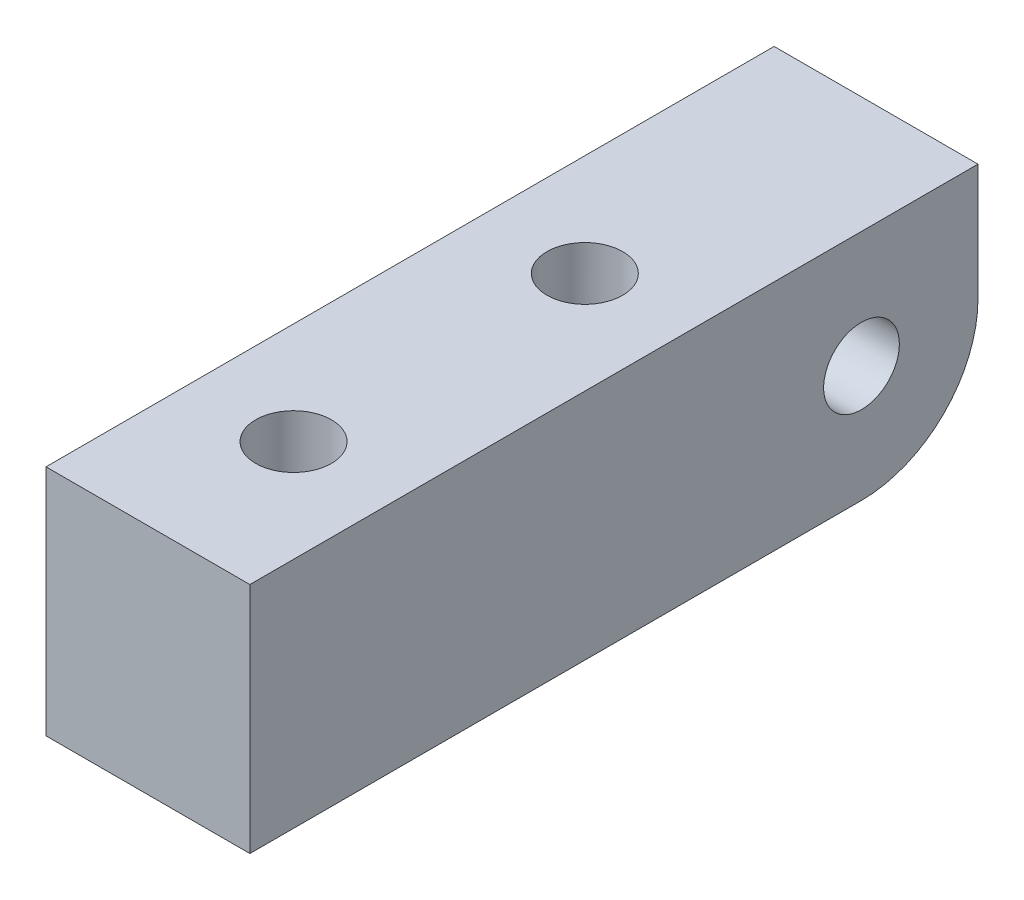
ISO-10303-21;
HEADER;
FILE_DESCRIPTION(('STEP AP214'),'2;1');
FILE_NAME('part.step','',(''),(''),'','','');
FILE_SCHEMA(('AUTOMOTIVE_DESIGN { 1 0 10303 214 1 1 1 1 }'));
ENDSEC;
DATA;
#1=APPLICATION_CONTEXT('core data for automotive mechanical design processes');
#2=APPLICATION_PROTOCOL_DEFINITION('international standard','automotive_design',2000,#1);
#3=PRODUCT_CONTEXT('',#1,'mechanical');
#4=PRODUCT('Part','Part','',(#3));
#5=PRODUCT_RELATED_PRODUCT_CATEGORY('part','',(#4));
#6=PRODUCT_DEFINITION_FORMATION('','',#4);
#7=PRODUCT_DEFINITION_CONTEXT('part definition',#1,'design');
#8=PRODUCT_DEFINITION('design','',#6,#7);
#9=PRODUCT_DEFINITION_SHAPE('','',#8);
#10=(LENGTH_UNIT() NAMED_UNIT(*) SI_UNIT(.MILLI.,.METRE.));
#11=(NAMED_UNIT(*) PLANE_ANGLE_UNIT() SI_UNIT($,.RADIAN.));
#12=(NAMED_UNIT(*) SI_UNIT($,.STERADIAN.) SOLID_ANGLE_UNIT());
#13=UNCERTAINTY_MEASURE_WITH_UNIT(LENGTH_MEASURE(1.E-05),#10,'distance_accuracy_value','');
#14=(GEOMETRIC_REPRESENTATION_CONTEXT(3) GLOBAL_UNCERTAINTY_ASSIGNED_CONTEXT((#13)) GLOBAL_UNIT_ASSIGNED_CONTEXT((#10,
#11,#12)) REPRESENTATION_CONTEXT('',''));
#15=CARTESIAN_POINT('',(0.,0.,0.));
#16=DIRECTION('',(0.,0.,1.));
#17=DIRECTION('',(1.,0.,0.));
#18=AXIS2_PLACEMENT_3D('',#15,#16,#17);
#19=CARTESIAN_POINT('',(0.,-4.00000000000001,16.));
#20=DIRECTION('',(0.,1.,0.));
#21=DIRECTION('',(0.,0.,1.));
#22=AXIS2_PLACEMENT_3D('',#19,#20,#21);
#23=CYLINDRICAL_SURFACE('',#22,1.3);
#24=CARTESIAN_POINT('',(0.,4.,16.));
#25=DIRECTION('',(0.,1.,0.));
#26=DIRECTION('',(0.,0.,1.));
#27=AXIS2_PLACEMENT_3D('',#24,#25,#26);
#28=CIRCLE('',#27,1.3);
#29=CARTESIAN_POINT('',(0.,4.,17.3));
#30=VERTEX_POINT('',#29);
#31=EDGE_CURVE('E148',#30,#30,#28,.T.);
#32=ORIENTED_EDGE('',*,*,#31,.T.);
#33=EDGE_LOOP('',(#32));
#34=FACE_BOUND('',#33,.T.);
#35=CARTESIAN_POINT('',(0.,-1.,16.));
#36=DIRECTION('',(0.,-1.,0.));
#37=DIRECTION('',(0.,0.,-1.));
#38=AXIS2_PLACEMENT_3D('',#35,#36,#37);
#39=CIRCLE('',#38,1.3);
#40=CARTESIAN_POINT('',(0.,-1.,14.7));
#41=VERTEX_POINT('',#40);
#42=EDGE_CURVE('E49',#41,#41,#39,.F.);
#43=ORIENTED_EDGE('',*,*,#42,.F.);
#44=EDGE_LOOP('',(#43));
#45=FACE_BOUND('',#44,.T.);
#46=ADVANCED_FACE('F45',(#34,#45),#23,.F.);
#47=CARTESIAN_POINT('',(0.,-4.,6.));
#48=DIRECTION('',(0.,1.,0.));
#49=DIRECTION('',(0.,0.,1.));
#50=AXIS2_PLACEMENT_3D('',#47,#48,#49);
#51=CYLINDRICAL_SURFACE('',#50,1.3);
#52=CARTESIAN_POINT('',(0.,4.,6.));
#53=DIRECTION('',(0.,1.,0.));
#54=DIRECTION('',(0.,0.,1.));
#55=AXIS2_PLACEMENT_3D('',#52,#53,#54);
#56=CIRCLE('',#55,1.3);
#57=CARTESIAN_POINT('',(0.,4.,7.3));
#58=VERTEX_POINT('',#57);
#59=EDGE_CURVE('E129',#58,#58,#56,.T.);
#60=ORIENTED_EDGE('',*,*,#59,.T.);
#61=EDGE_LOOP('',(#60));
#62=FACE_BOUND('',#61,.T.);
#63=CARTESIAN_POINT('',(0.,-1.,6.));
#64=DIRECTION('',(0.,-1.,0.));
#65=DIRECTION('',(0.,0.,-1.));
#66=AXIS2_PLACEMENT_3D('',#63,#64,#65);
#67=CIRCLE('',#66,1.3);
#68=CARTESIAN_POINT('',(0.,-1.,4.7));
#69=VERTEX_POINT('',#68);
#70=EDGE_CURVE('E142',#69,#69,#67,.F.);
#71=ORIENTED_EDGE('',*,*,#70,.F.);
#72=EDGE_LOOP('',(#71));
#73=FACE_BOUND('',#72,.T.);
#74=ADVANCED_FACE('F187',(#62,#73),#51,.F.);
#75=CARTESIAN_POINT('',(3.5,-4.,0.));
#76=DIRECTION('',(0.,-1.,0.));
#77=DIRECTION('',(0.,0.,-1.));
#78=AXIS2_PLACEMENT_3D('',#75,#76,#77);
#79=PLANE('',#78);
#80=CARTESIAN_POINT('',(0.,-4.,16.));
#81=DIRECTION('',(0.,-1.,0.));
#82=DIRECTION('',(0.,0.,-1.));
#83=AXIS2_PLACEMENT_3D('',#80,#81,#82);
#84=CIRCLE('',#83,2.5);
#85=CARTESIAN_POINT('',(0.,-4.,13.5));
#86=VERTEX_POINT('',#85);
#87=EDGE_CURVE('E150',#86,#86,#84,.T.);
#88=ORIENTED_EDGE('',*,*,#87,.F.);
#89=EDGE_LOOP('',(#88));
#90=FACE_BOUND('',#89,.T.);
#91=CARTESIAN_POINT('',(0.,-4.,6.));
#92=DIRECTION('',(0.,-1.,0.));
#93=DIRECTION('',(0.,0.,-1.));
#94=AXIS2_PLACEMENT_3D('',#91,#92,#93);
#95=CIRCLE('',#94,2.5);
#96=CARTESIAN_POINT('',(0.,-4.,3.5));
#97=VERTEX_POINT('',#96);
#98=EDGE_CURVE('E160',#97,#97,#95,.T.);
#99=ORIENTED_EDGE('',*,*,#98,.F.);
#100=EDGE_LOOP('',(#99));
#101=FACE_BOUND('',#100,.T.);
#102=DIRECTION('',(0.,0.,1.));
#103=VECTOR('',#102,1.);
#104=CARTESIAN_POINT('',(-3.5,-4.,0.));
#105=LINE('',#104,#103);
#106=CARTESIAN_POINT('',(-3.5,-4.,0.));
#107=VERTEX_POINT('',#106);
#108=CARTESIAN_POINT('',(-3.5,-4.,21.));
#109=VERTEX_POINT('',#108);
#110=EDGE_CURVE('E128',#107,#109,#105,.T.);
#111=ORIENTED_EDGE('',*,*,#110,.F.);
#112=DIRECTION('',(-1.,0.,0.));
#113=VECTOR('',#112,1.);
#114=CARTESIAN_POINT('',(3.5,-4.,0.));
#115=LINE('',#114,#113);
#116=CARTESIAN_POINT('',(3.5,-4.,0.));
#117=VERTEX_POINT('',#116);
#118=EDGE_CURVE('E54',#107,#117,#115,.F.);
#119=ORIENTED_EDGE('',*,*,#118,.T.);
#120=DIRECTION('',(0.,0.,1.));
#121=VECTOR('',#120,1.);
#122=CARTESIAN_POINT('',(3.5,-4.,0.));
#123=LINE('',#122,#121);
#124=CARTESIAN_POINT('',(3.5,-4.,21.));
#125=VERTEX_POINT('',#124);
#126=EDGE_CURVE('E117',#117,#125,#123,.T.);
#127=ORIENTED_EDGE('',*,*,#126,.T.);
#128=DIRECTION('',(-1.,0.,0.));
#129=VECTOR('',#128,1.);
#130=CARTESIAN_POINT('',(3.5,-4.,21.));
#131=LINE('',#130,#129);
#132=EDGE_CURVE('E124',#125,#109,#131,.T.);
#133=ORIENTED_EDGE('',*,*,#132,.T.);
#134=EDGE_LOOP('',(#111,#119,#127,#133));
#135=FACE_BOUND('',#134,.T.);
#136=ADVANCED_FACE('F192',(#90,#101,#135),#79,.T.);
#137=CARTESIAN_POINT('',(3.5,0.,-4.));
#138=DIRECTION('',(0.,0.,-1.));
#139=DIRECTION('',(0.,1.,0.));
#140=AXIS2_PLACEMENT_3D('',#137,#138,#139);
#141=PLANE('',#140);
#142=DIRECTION('',(0.,-1.,0.));
#143=VECTOR('',#142,1.);
#144=CARTESIAN_POINT('',(3.5,0.,-4.));
#145=LINE('',#144,#143);
#146=CARTESIAN_POINT('',(3.5,4.,-4.));
#147=VERTEX_POINT('',#146);
#148=CARTESIAN_POINT('',(3.5,0.,-4.));
#149=VERTEX_POINT('',#148);
#150=EDGE_CURVE('E97',#147,#149,#145,.T.);
#151=ORIENTED_EDGE('',*,*,#150,.T.);
#152=DIRECTION('',(-1.,0.,0.));
#153=VECTOR('',#152,1.);
#154=CARTESIAN_POINT('',(3.5,0.,-4.));
#155=LINE('',#154,#153);
#156=CARTESIAN_POINT('',(-3.5,0.,-4.));
#157=VERTEX_POINT('',#156);
#158=EDGE_CURVE('E103',#149,#157,#155,.T.);
#159=ORIENTED_EDGE('',*,*,#158,.T.);
#160=DIRECTION('',(0.,-1.,0.));
#161=VECTOR('',#160,1.);
#162=CARTESIAN_POINT('',(-3.5,0.,-4.));
#163=LINE('',#162,#161);
#164=CARTESIAN_POINT('',(-3.5,4.,-4.));
#165=VERTEX_POINT('',#164);
#166=EDGE_CURVE('E99',#165,#157,#163,.T.);
#167=ORIENTED_EDGE('',*,*,#166,.F.);
#168=DIRECTION('',(-1.,0.,0.));
#169=VECTOR('',#168,1.);
#170=CARTESIAN_POINT('',(3.5,4.,-4.));
#171=LINE('',#170,#169);
#172=EDGE_CURVE('E92',#147,#165,#171,.T.);
#173=ORIENTED_EDGE('',*,*,#172,.F.);
#174=EDGE_LOOP('',(#151,#159,#167,#173));
#175=FACE_BOUND('',#174,.T.);
#176=ADVANCED_FACE('F94',(#175),#141,.T.);
#177=CARTESIAN_POINT('',(3.5,4.,0.));
#178=DIRECTION('',(0.,-1.,0.));
#179=DIRECTION('',(0.,0.,-1.));
#180=AXIS2_PLACEMENT_3D('',#177,#178,#179);
#181=PLANE('',#180);
#182=ORIENTED_EDGE('',*,*,#59,.F.);
#183=EDGE_LOOP('',(#182));
#184=FACE_BOUND('',#183,.T.);
#185=ORIENTED_EDGE('',*,*,#31,.F.);
#186=EDGE_LOOP('',(#185));
#187=FACE_BOUND('',#186,.T.);
#188=DIRECTION('',(0.,0.,1.));
#189=VECTOR('',#188,1.);
#190=CARTESIAN_POINT('',(-3.5,4.,0.));
#191=LINE('',#190,#189);
#192=CARTESIAN_POINT('',(-3.5,4.,21.));
#193=VERTEX_POINT('',#192);
#194=EDGE_CURVE('E132',#165,#193,#191,.T.);
#195=ORIENTED_EDGE('',*,*,#194,.T.);
#196=DIRECTION('',(-1.,0.,0.));
#197=VECTOR('',#196,1.);
#198=CARTESIAN_POINT('',(3.5,4.,21.));
#199=LINE('',#198,#197);
#200=CARTESIAN_POINT('',(3.5,4.,21.));
#201=VERTEX_POINT('',#200);
#202=EDGE_CURVE('E104',#201,#193,#199,.T.);
#203=ORIENTED_EDGE('',*,*,#202,.F.);
#204=DIRECTION('',(0.,0.,1.));
#205=VECTOR('',#204,1.);
#206=CARTESIAN_POINT('',(3.5,4.,0.));
#207=LINE('',#206,#205);
#208=EDGE_CURVE('E108',#147,#201,#207,.T.);
#209=ORIENTED_EDGE('',*,*,#208,.F.);
#210=ORIENTED_EDGE('',*,*,#172,.T.);
#211=EDGE_LOOP('',(#195,#203,#209,#210));
#212=FACE_BOUND('',#211,.T.);
#213=ADVANCED_FACE('F109',(#184,#187,#212),#181,.F.);
#214=CARTESIAN_POINT('',(3.5,0.,0.));
#215=DIRECTION('',(-1.,0.,0.));
#216=DIRECTION('',(0.,0.,1.));
#217=AXIS2_PLACEMENT_3D('',#214,#215,#216);
#218=CYLINDRICAL_SURFACE('',#217,1.3);
#219=CARTESIAN_POINT('',(3.5,0.,0.));
#220=DIRECTION('',(1.,0.,0.));
#221=DIRECTION('',(0.,0.,-1.));
#222=AXIS2_PLACEMENT_3D('',#219,#220,#221);
#223=CIRCLE('',#222,1.3);
#224=CARTESIAN_POINT('',(3.5,0.,-1.3));
#225=VERTEX_POINT('',#224);
#226=EDGE_CURVE('E119',#225,#225,#223,.T.);
#227=ORIENTED_EDGE('',*,*,#226,.T.);
#228=EDGE_LOOP('',(#227));
#229=FACE_BOUND('',#228,.T.);
#230=CARTESIAN_POINT('',(-3.5,0.,0.));
#231=DIRECTION('',(1.,0.,0.));
#232=DIRECTION('',(0.,0.,-1.));
#233=AXIS2_PLACEMENT_3D('',#230,#231,#232);
#234=CIRCLE('',#233,1.3);
#235=CARTESIAN_POINT('',(-3.5,0.,-1.3));
#236=VERTEX_POINT('',#235);
#237=EDGE_CURVE('E125',#236,#236,#234,.T.);
#238=ORIENTED_EDGE('',*,*,#237,.F.);
#239=EDGE_LOOP('',(#238));
#240=FACE_BOUND('',#239,.T.);
#241=ADVANCED_FACE('F169',(#229,#240),#218,.F.);
#242=CARTESIAN_POINT('',(3.5,0.,21.));
#243=DIRECTION('',(0.,0.,-1.));
#244=DIRECTION('',(-1.,0.,0.));
#245=AXIS2_PLACEMENT_3D('',#242,#243,#244);
#246=PLANE('',#245);
#247=DIRECTION('',(0.,-1.,0.));
#248=VECTOR('',#247,1.);
#249=CARTESIAN_POINT('',(-3.5,0.,21.));
#250=LINE('',#249,#248);
#251=EDGE_CURVE('E134',#193,#109,#250,.T.);
#252=ORIENTED_EDGE('',*,*,#251,.T.);
#253=ORIENTED_EDGE('',*,*,#132,.F.);
#254=DIRECTION('',(0.,-1.,0.));
#255=VECTOR('',#254,1.);
#256=CARTESIAN_POINT('',(3.5,0.,21.));
#257=LINE('',#256,#255);
#258=EDGE_CURVE('E113',#201,#125,#257,.T.);
#259=ORIENTED_EDGE('',*,*,#258,.F.);
#260=ORIENTED_EDGE('',*,*,#202,.T.);
#261=EDGE_LOOP('',(#252,#253,#259,#260));
#262=FACE_BOUND('',#261,.T.);
#263=ADVANCED_FACE('F174',(#262),#246,.F.);
#264=CARTESIAN_POINT('',(3.5,0.,0.));
#265=DIRECTION('',(1.,0.,0.));
#266=DIRECTION('',(0.,0.,-1.));
#267=AXIS2_PLACEMENT_3D('',#264,#265,#266);
#268=PLANE('',#267);
#269=ORIENTED_EDGE('',*,*,#226,.F.);
#270=EDGE_LOOP('',(#269));
#271=FACE_BOUND('',#270,.T.);
#272=ORIENTED_EDGE('',*,*,#126,.F.);
#273=CARTESIAN_POINT('',(3.5,0.,0.));
#274=DIRECTION('',(1.,0.,0.));
#275=DIRECTION('',(0.,0.,-1.));
#276=AXIS2_PLACEMENT_3D('',#273,#274,#275);
#277=CIRCLE('',#276,4.);
#278=EDGE_CURVE('E11',#117,#149,#277,.T.);
#279=ORIENTED_EDGE('',*,*,#278,.T.);
#280=ORIENTED_EDGE('',*,*,#150,.F.);
#281=ORIENTED_EDGE('',*,*,#208,.T.);
#282=ORIENTED_EDGE('',*,*,#258,.T.);
#283=EDGE_LOOP('',(#272,#279,#280,#281,#282));
#284=FACE_BOUND('',#283,.T.);
#285=ADVANCED_FACE('F115',(#271,#284),#268,.T.);
#286=CARTESIAN_POINT('',(-3.5,0.,0.));
#287=DIRECTION('',(1.,0.,0.));
#288=DIRECTION('',(0.,0.,-1.));
#289=AXIS2_PLACEMENT_3D('',#286,#287,#288);
#290=PLANE('',#289);
#291=ORIENTED_EDGE('',*,*,#237,.T.);
#292=EDGE_LOOP('',(#291));
#293=FACE_BOUND('',#292,.T.);
#294=ORIENTED_EDGE('',*,*,#166,.T.);
#295=CARTESIAN_POINT('',(-3.5,0.,0.));
#296=DIRECTION('',(1.,0.,0.));
#297=DIRECTION('',(0.,0.,-1.));
#298=AXIS2_PLACEMENT_3D('',#295,#296,#297);
#299=CIRCLE('',#298,4.);
#300=EDGE_CURVE('E69',#157,#107,#299,.F.);
#301=ORIENTED_EDGE('',*,*,#300,.T.);
#302=ORIENTED_EDGE('',*,*,#110,.T.);
#303=ORIENTED_EDGE('',*,*,#251,.F.);
#304=ORIENTED_EDGE('',*,*,#194,.F.);
#305=EDGE_LOOP('',(#294,#301,#302,#303,#304));
#306=FACE_BOUND('',#305,.T.);
#307=ADVANCED_FACE('F173',(#293,#306),#290,.F.);
#308=CARTESIAN_POINT('',(3.5,0.,0.));
#309=DIRECTION('',(-1.,0.,0.));
#310=DIRECTION('',(0.,0.,1.));
#311=AXIS2_PLACEMENT_3D('',#308,#309,#310);
#312=CYLINDRICAL_SURFACE('',#311,4.);
#313=ORIENTED_EDGE('',*,*,#278,.F.);
#314=ORIENTED_EDGE('',*,*,#118,.F.);
#315=ORIENTED_EDGE('',*,*,#300,.F.);
#316=ORIENTED_EDGE('',*,*,#158,.F.);
#317=EDGE_LOOP('',(#313,#314,#315,#316));
#318=FACE_BOUND('',#317,.T.);
#319=ADVANCED_FACE('F47',(#318),#312,.T.);
#320=CARTESIAN_POINT('',(0.,-1.,6.));
#321=DIRECTION('',(0.,-1.,0.));
#322=DIRECTION('',(0.,0.,-1.));
#323=AXIS2_PLACEMENT_3D('',#320,#321,#322);
#324=PLANE('',#323);
#325=CARTESIAN_POINT('',(0.,-1.,6.));
#326=DIRECTION('',(0.,-1.,0.));
#327=DIRECTION('',(0.,0.,-1.));
#328=AXIS2_PLACEMENT_3D('',#325,#326,#327);
#329=CIRCLE('',#328,2.5);
#330=CARTESIAN_POINT('',(0.,-1.,3.5));
#331=VERTEX_POINT('',#330);
#332=EDGE_CURVE('E155',#331,#331,#329,.T.);
#333=ORIENTED_EDGE('',*,*,#332,.T.);
#334=EDGE_LOOP('',(#333));
#335=FACE_BOUND('',#334,.T.);
#336=ORIENTED_EDGE('',*,*,#70,.T.);
#337=EDGE_LOOP('',(#336));
#338=FACE_BOUND('',#337,.T.);
#339=ADVANCED_FACE('F201',(#335,#338),#324,.T.);
#340=CARTESIAN_POINT('',(0.,-1.,6.));
#341=DIRECTION('',(0.,-1.,0.));
#342=DIRECTION('',(0.,0.,-1.));
#343=AXIS2_PLACEMENT_3D('',#340,#341,#342);
#344=CYLINDRICAL_SURFACE('',#343,2.5);
#345=ORIENTED_EDGE('',*,*,#332,.F.);
#346=EDGE_LOOP('',(#345));
#347=FACE_BOUND('',#346,.T.);
#348=ORIENTED_EDGE('',*,*,#98,.T.);
#349=EDGE_LOOP('',(#348));
#350=FACE_BOUND('',#349,.T.);
#351=ADVANCED_FACE('F197',(#347,#350),#344,.F.);
#352=CARTESIAN_POINT('',(0.,-1.,16.));
#353=DIRECTION('',(0.,-1.,0.));
#354=DIRECTION('',(0.,0.,-1.));
#355=AXIS2_PLACEMENT_3D('',#352,#353,#354);
#356=PLANE('',#355);
#357=CARTESIAN_POINT('',(0.,-1.,16.));
#358=DIRECTION('',(0.,-1.,0.));
#359=DIRECTION('',(0.,0.,-1.));
#360=AXIS2_PLACEMENT_3D('',#357,#358,#359);
#361=CIRCLE('',#360,2.5);
#362=CARTESIAN_POINT('',(0.,-1.,13.5));
#363=VERTEX_POINT('',#362);
#364=EDGE_CURVE('E144',#363,#363,#361,.T.);
#365=ORIENTED_EDGE('',*,*,#364,.T.);
#366=EDGE_LOOP('',(#365));
#367=FACE_BOUND('',#366,.T.);
#368=ORIENTED_EDGE('',*,*,#42,.T.);
#369=EDGE_LOOP('',(#368));
#370=FACE_BOUND('',#369,.T.);
#371=ADVANCED_FACE('F200',(#367,#370),#356,.T.);
#372=CARTESIAN_POINT('',(0.,-1.,16.));
#373=DIRECTION('',(0.,-1.,0.));
#374=DIRECTION('',(0.,0.,-1.));
#375=AXIS2_PLACEMENT_3D('',#372,#373,#374);
#376=CYLINDRICAL_SURFACE('',#375,2.5);
#377=ORIENTED_EDGE('',*,*,#364,.F.);
#378=EDGE_LOOP('',(#377));
#379=FACE_BOUND('',#378,.T.);
#380=ORIENTED_EDGE('',*,*,#87,.T.);
#381=EDGE_LOOP('',(#380));
#382=FACE_BOUND('',#381,.T.);
#383=ADVANCED_FACE('F206',(#379,#382),#376,.F.);
#384=CLOSED_SHELL('',(#46,#74,#136,#176,#213,#241,#263,#285,#307,#319,#339,#351,#371,#383));
#385=MANIFOLD_SOLID_BREP('B2',#384);
#386=ADVANCED_BREP_SHAPE_REPRESENTATION('',(#18,#385),#14);
#387=SHAPE_DEFINITION_REPRESENTATION(#9,#386);
ENDSEC;
END-ISO-10303-21;
